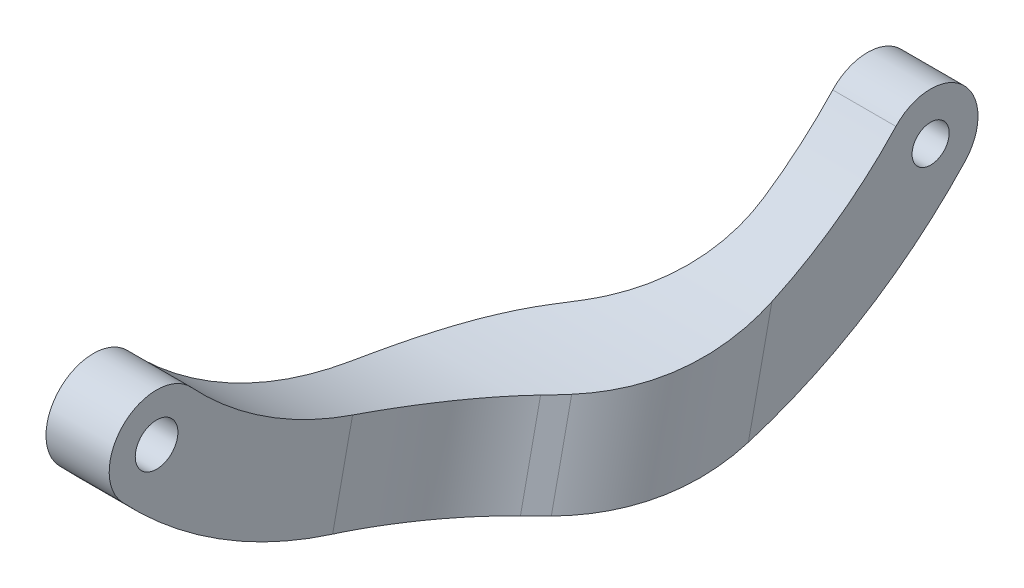
ISO-10303-21;
HEADER;
FILE_DESCRIPTION(('STEP AP214'),'2;1');
FILE_NAME('part.step','',(''),(''),'','','');
FILE_SCHEMA(('AUTOMOTIVE_DESIGN { 1 0 10303 214 1 1 1 1 }'));
ENDSEC;
DATA;
#1=APPLICATION_CONTEXT('core data for automotive mechanical design processes');
#2=APPLICATION_PROTOCOL_DEFINITION('international standard','automotive_design',2000,#1);
#3=PRODUCT_CONTEXT('',#1,'mechanical');
#4=PRODUCT('Part','Part','',(#3));
#5=PRODUCT_RELATED_PRODUCT_CATEGORY('part','',(#4));
#6=PRODUCT_DEFINITION_FORMATION('','',#4);
#7=PRODUCT_DEFINITION_CONTEXT('part definition',#1,'design');
#8=PRODUCT_DEFINITION('design','',#6,#7);
#9=PRODUCT_DEFINITION_SHAPE('','',#8);
#10=(LENGTH_UNIT() NAMED_UNIT(*) SI_UNIT(.MILLI.,.METRE.));
#11=(NAMED_UNIT(*) PLANE_ANGLE_UNIT() SI_UNIT($,.RADIAN.));
#12=(NAMED_UNIT(*) SI_UNIT($,.STERADIAN.) SOLID_ANGLE_UNIT());
#13=UNCERTAINTY_MEASURE_WITH_UNIT(LENGTH_MEASURE(1.E-05),#10,'distance_accuracy_value','');
#14=(GEOMETRIC_REPRESENTATION_CONTEXT(3) GLOBAL_UNCERTAINTY_ASSIGNED_CONTEXT((#13)) GLOBAL_UNIT_ASSIGNED_CONTEXT((#10,
#11,#12)) REPRESENTATION_CONTEXT('',''));
#15=CARTESIAN_POINT('',(0.,0.,0.));
#16=DIRECTION('',(0.,0.,1.));
#17=DIRECTION('',(1.,0.,0.));
#18=AXIS2_PLACEMENT_3D('',#15,#16,#17);
#19=CARTESIAN_POINT('',(4.,0.,20.5));
#20=DIRECTION('',(-1.,0.,0.));
#21=DIRECTION('',(0.,0.,1.));
#22=AXIS2_PLACEMENT_3D('',#19,#20,#21);
#23=CYLINDRICAL_SURFACE('',#22,1.35);
#24=CARTESIAN_POINT('',(4.,0.,20.5));
#25=DIRECTION('',(1.,0.,0.));
#26=DIRECTION('',(0.,0.,-1.));
#27=AXIS2_PLACEMENT_3D('',#24,#25,#26);
#28=CIRCLE('',#27,1.35);
#29=CARTESIAN_POINT('',(4.,0.,19.15));
#30=VERTEX_POINT('',#29);
#31=EDGE_CURVE('E332',#30,#30,#28,.T.);
#32=ORIENTED_EDGE('',*,*,#31,.T.);
#33=EDGE_LOOP('',(#32));
#34=FACE_BOUND('',#33,.T.);
#35=CARTESIAN_POINT('',(1.,0.,20.5));
#36=DIRECTION('',(-1.,0.,0.));
#37=DIRECTION('',(0.,0.,1.));
#38=AXIS2_PLACEMENT_3D('',#35,#36,#37);
#39=CIRCLE('',#38,1.35);
#40=CARTESIAN_POINT('',(1.,0.,21.85));
#41=VERTEX_POINT('',#40);
#42=EDGE_CURVE('E182',#41,#41,#39,.T.);
#43=ORIENTED_EDGE('',*,*,#42,.T.);
#44=EDGE_LOOP('',(#43));
#45=FACE_BOUND('',#44,.T.);
#46=ADVANCED_FACE('F45',(#34,#45),#23,.F.);
#47=CARTESIAN_POINT('',(4.,19.0722311227607,0.));
#48=DIRECTION('',(-1.,0.,0.));
#49=DIRECTION('',(0.,0.,1.));
#50=AXIS2_PLACEMENT_3D('',#47,#48,#49);
#51=CYLINDRICAL_SURFACE('',#50,25.);
#52=CARTESIAN_POINT('',(1.99999999999982,19.0722311227607,0.));
#53=DIRECTION('',(-0.707106781186544,-0.147816494294591,-0.691484116964708));
#54=DIRECTION('',(-0.707106781186551,0.147816494294589,0.691484116964701));
#55=AXIS2_PLACEMENT_3D('',#52,#53,#54);
#56=ELLIPSE('',#55,35.3553390593276,25.);
#57=CARTESIAN_POINT('',(7.51471862576149,-5.92602228819655,-0.29551040855904));
#58=VERTEX_POINT('',#57);
#59=CARTESIAN_POINT('',(8.48528137423854,-5.89421621463096,-1.29480011942044));
#60=VERTEX_POINT('',#59);
#61=EDGE_CURVE('E187',#58,#60,#56,.F.);
#62=ORIENTED_EDGE('',*,*,#61,.T.);
#63=CARTESIAN_POINT('',(8.48528137423853,-5.89421621463096,-1.29480011942042));
#64=CARTESIAN_POINT('',(8.59867285164074,-5.88813550712738,-1.41205145218557));
#65=CARTESIAN_POINT('',(8.70958465029113,-5.88110570858869,-1.53162319514024));
#66=CARTESIAN_POINT('',(8.92629957940963,-5.86496337583373,-1.77517036013413));
#67=CARTESIAN_POINT('',(9.03210280255711,-5.8558508794188,-1.89914570221274));
#68=CARTESIAN_POINT('',(9.34154808412654,-5.82512044837523,-2.27722579073465));
#69=CARTESIAN_POINT('',(9.53731787727653,-5.8001049430657,-2.53757999504009));
#70=CARTESIAN_POINT('',(9.90553356687775,-5.73989390432,-3.07083585190078));
#71=CARTESIAN_POINT('',(10.0781101559172,-5.70475925217093,-3.34365448861928));
#72=CARTESIAN_POINT('',(10.4006110251683,-5.62318193487899,-3.9007432539146));
#73=CARTESIAN_POINT('',(10.5505359838089,-5.57673960851615,-4.18501303919996));
#74=CARTESIAN_POINT('',(10.8274422499721,-5.47171946586164,-4.76241631318454));
#75=CARTESIAN_POINT('',(10.9544181815503,-5.41313881297647,-5.0555518600154));
#76=CARTESIAN_POINT('',(11.185480557955,-5.28330816536979,-5.64797962231596));
#77=CARTESIAN_POINT('',(11.2895652613934,-5.21205720753439,-5.94727230428042));
#78=CARTESIAN_POINT('',(11.4754334349686,-5.05651728357979,-6.5498423253075));
#79=CARTESIAN_POINT('',(11.557185688062,-4.9722103225017,-6.85312462718402));
#80=CARTESIAN_POINT('',(11.6989979415523,-4.79065989901722,-7.46076708218535));
#81=CARTESIAN_POINT('',(11.7590616422833,-4.6934186472376,-7.76512704249201));
#82=CARTESIAN_POINT('',(11.8747990437493,-4.45242830436828,-8.47178858508545));
#83=CARTESIAN_POINT('',(11.9226915947409,-4.30383918757815,-8.87374977045388));
#84=CARTESIAN_POINT('',(11.9696254672786,-4.06518951307501,-9.47131078683301));
#85=CARTESIAN_POINT('',(11.9811206581418,-3.98315430652908,-9.66929163274227));
#86=CARTESIAN_POINT('',(11.9963064961889,-3.8139069769279,-10.063331503492));
#87=CARTESIAN_POINT('',(11.9999972050115,-3.72669489476448,-10.2593905434984));
#88=CARTESIAN_POINT('',(12.,-3.63695797400753,-10.4543163605864));
#89=B_SPLINE_CURVE_WITH_KNOTS('',3,(#63,#64,#65,#66,#67,#68,#69,#70,#71,#72,#73,#74,#75,#76,#77,
#78,#79,#80,#81,#82,#83,#84,#85,#86,#87,#88),.UNSPECIFIED.,.F.,.F.,(4,2,2,2,2,2,2,2,2,2,2,2,4),
(0.,0.489596614265084,0.979184342967121,1.95796306082216,2.93097181208641,3.90395141541273,
4.87715865033372,5.85043989376419,6.82507474032123,7.79954322351979,9.09094210412101,
9.73460562922835,10.3782640707513),.UNSPECIFIED.);
#90=CARTESIAN_POINT('',(12.,-3.63695797400752,-10.4543163605864));
#91=VERTEX_POINT('',#90);
#92=EDGE_CURVE('E269',#60,#91,#89,.T.);
#93=ORIENTED_EDGE('',*,*,#92,.T.);
#94=CARTESIAN_POINT('',(12.,19.0722311227607,0.));
#95=DIRECTION('',(1.,0.,0.));
#96=DIRECTION('',(0.,0.,-1.));
#97=AXIS2_PLACEMENT_3D('',#94,#95,#96);
#98=CIRCLE('',#97,25.);
#99=CARTESIAN_POINT('',(12.,2.04345333458149,-18.3035714285714));
#100=VERTEX_POINT('',#99);
#101=EDGE_CURVE('E342',#91,#100,#98,.T.);
#102=ORIENTED_EDGE('',*,*,#101,.T.);
#103=DIRECTION('',(-1.,0.,0.));
#104=VECTOR('',#103,1.);
#105=CARTESIAN_POINT('',(4.,2.04345333458149,-18.3035714285714));
#106=LINE('',#105,#104);
#107=CARTESIAN_POINT('',(8.,2.04345333458149,-18.3035714285714));
#108=VERTEX_POINT('',#107);
#109=EDGE_CURVE('E171',#100,#108,#106,.T.);
#110=ORIENTED_EDGE('',*,*,#109,.T.);
#111=CARTESIAN_POINT('',(8.,19.0722311227607,0.));
#112=DIRECTION('',(1.,0.,0.));
#113=DIRECTION('',(0.,0.,-1.));
#114=AXIS2_PLACEMENT_3D('',#111,#112,#113);
#115=CIRCLE('',#114,25.);
#116=CARTESIAN_POINT('',(8.,-1.68038995029258,-13.940183592703));
#117=VERTEX_POINT('',#116);
#118=EDGE_CURVE('E162',#117,#108,#115,.T.);
#119=ORIENTED_EDGE('',*,*,#118,.F.);
#120=CARTESIAN_POINT('',(8.,-1.68038995029259,-13.940183592703));
#121=CARTESIAN_POINT('',(8.0000006447647,-1.76731669645823,-13.810779522855));
#122=CARTESIAN_POINT('',(7.99700455162078,-1.85301952102906,-13.6805757927997));
#123=CARTESIAN_POINT('',(7.9849935332434,-2.02185269140391,-13.4187882534438));
#124=CARTESIAN_POINT('',(7.97597869262896,-2.10498307335733,-13.2872044635714));
#125=CARTESIAN_POINT('',(7.93987660512794,-2.35027301366119,-12.8908020485648));
#126=CARTESIAN_POINT('',(7.90373182824183,-2.50839447835756,-12.6242383759934));
#127=CARTESIAN_POINT('',(7.80754571796463,-2.8123447489946,-12.0896496542054));
#128=CARTESIAN_POINT('',(7.74758217109181,-2.95821171496135,-11.8216321357815));
#129=CARTESIAN_POINT('',(7.60413670663273,-3.23762089578244,-11.2854717949295));
#130=CARTESIAN_POINT('',(7.52065548062648,-3.37116347290451,-11.0173289764175));
#131=CARTESIAN_POINT('',(7.33079172614606,-3.62559502450517,-10.483140549654));
#132=CARTESIAN_POINT('',(7.22440722973564,-3.74648291031706,-10.2170951236561));
#133=CARTESIAN_POINT('',(6.98956380624268,-3.9755482891721,-9.68930533106975));
#134=CARTESIAN_POINT('',(6.86110372936444,-4.08372511967182,-9.42756118928998));
#135=CARTESIAN_POINT('',(6.58307713178323,-4.28757862991995,-8.91047343522586));
#136=CARTESIAN_POINT('',(6.43350861078629,-4.38325412335073,-8.65513043223459));
#137=CARTESIAN_POINT('',(6.11439925625423,-4.56250250664319,-8.15294162398527));
#138=CARTESIAN_POINT('',(5.94486388526901,-4.64607869276094,-7.90609351845555));
#139=CARTESIAN_POINT('',(5.57311159144304,-4.80777163206693,-7.40406698794985));
#140=CARTESIAN_POINT('',(5.36938299699754,-4.88497145962042,-7.14971235281972));
#141=CARTESIAN_POINT('',(4.94198196575353,-5.02688136041803,-6.65574242050241));
#142=CARTESIAN_POINT('',(4.71835815156656,-5.09162072330045,-6.41609348299118));
#143=CARTESIAN_POINT('',(4.48528137423853,-5.1507111807628,-6.1845829414904));
#144=B_SPLINE_CURVE_WITH_KNOTS('',3,(#120,#121,#122,#123,#124,#125,#126,#127,#128,#129,#130,
#131,#132,#133,#134,#135,#136,#137,#138,#139,#140,#141,#142,#143),.UNSPECIFIED.,.F.,.F.,(4,2,2,
2,2,2,2,2,2,2,2,4),(0.,0.467596240150389,0.935185906390633,1.87002670498385,2.80183930735431,
3.73362451094543,4.66548980904839,5.59740365761386,6.52940587625938,7.46115370656914,
8.4646982641753,9.46585427697592),.UNSPECIFIED.);
#145=CARTESIAN_POINT('',(4.48528137423852,-5.1507111807628,-6.18458294149039));
#146=VERTEX_POINT('',#145);
#147=EDGE_CURVE('E239',#117,#146,#144,.T.);
#148=ORIENTED_EDGE('',*,*,#147,.T.);
#149=CARTESIAN_POINT('',(10.0000000000002,19.0722311227607,0.));
#150=DIRECTION('',(0.707106781186544,-0.321749028247022,0.629664643141174));
#151=DIRECTION('',(-0.707106781186551,-0.321749028247019,0.629664643141168));
#152=AXIS2_PLACEMENT_3D('',#149,#150,#151);
#153=ELLIPSE('',#152,35.3553390593276,25.);
#154=CARTESIAN_POINT('',(3.51471862576147,-5.37862408161887,-5.21111118423573));
#155=VERTEX_POINT('',#154);
#156=EDGE_CURVE('E181',#146,#155,#153,.F.);
#157=ORIENTED_EDGE('',*,*,#156,.T.);
#158=CARTESIAN_POINT('',(3.51471862576147,-5.37862408161887,-5.21111118423573));
#159=CARTESIAN_POINT('',(3.40132714835927,-5.40309744718233,-5.09628129084143));
#160=CARTESIAN_POINT('',(3.29041534970887,-5.42725462755297,-4.97896441048207));
#161=CARTESIAN_POINT('',(3.07370042059037,-5.47469697612954,-4.73953797074562));
#162=CARTESIAN_POINT('',(2.96789719744289,-5.49798216015344,-4.61742849838826));
#163=CARTESIAN_POINT('',(2.65845191587346,-5.56615317063897,-4.244277555661));
#164=CARTESIAN_POINT('',(2.46268212272347,-5.60937467454959,-3.98632021654247));
#165=CARTESIAN_POINT('',(2.09446643312225,-5.68923204886544,-3.45565084882803));
#166=CARTESIAN_POINT('',(1.92188984408278,-5.72590523999864,-3.18303476460943));
#167=CARTESIAN_POINT('',(1.59938897483173,-5.79129278465805,-2.62381457531166));
#168=CARTESIAN_POINT('',(1.4494640161911,-5.82000737657028,-2.33721088950931));
#169=CARTESIAN_POINT('',(1.17255775002795,-5.86800867251149,-1.75230094194538));
#170=CARTESIAN_POINT('',(1.04558181844973,-5.8872931692852,-1.45399195801685));
#171=CARTESIAN_POINT('',(0.81451944204503,-5.91521798144893,-0.848148037961502));
#172=CARTESIAN_POINT('',(0.710434738606563,-5.9238574872801,-0.540612401963109));
#173=CARTESIAN_POINT('',(0.524566565031372,-5.92957405516294,0.0816822380877375));
#174=CARTESIAN_POINT('',(0.442814311938032,-5.92663501988984,0.396450693288391));
#175=CARTESIAN_POINT('',(0.301002058447687,-5.90854021703966,1.03037694096808));
#176=CARTESIAN_POINT('',(0.240938357716654,-5.89338653485906,1.34953397504678));
#177=CARTESIAN_POINT('',(0.125200956250701,-5.84350520446004,2.09448949990342));
#178=CARTESIAN_POINT('',(0.0773084052590687,-5.8040143492123,2.5212118833368));
#179=CARTESIAN_POINT('',(0.0303745327213871,-5.72815663682397,3.16017858270988));
#180=CARTESIAN_POINT('',(0.0188793418581842,-5.70015792564313,3.3726456687072));
#181=CARTESIAN_POINT('',(0.00369350381111975,-5.63866258203065,3.79706338868547));
#182=CARTESIAN_POINT('',(2.79498853896766E-06,-5.60516599302273,4.00901402673206));
#183=CARTESIAN_POINT('',(0.,-5.56893729753649,4.22052353180866));
#184=B_SPLINE_CURVE_WITH_KNOTS('',3,(#158,#159,#160,#161,#162,#163,#164,#165,#166,#167,#168,
#169,#170,#171,#172,#173,#174,#175,#176,#177,#178,#179,#180,#181,#182,#183),.UNSPECIFIED.,.F.,
.F.,(4,2,2,2,2,2,2,2,2,2,2,2,4),(0.,0.489596614265083,0.979184342967119,1.95796306082215,
2.93097181208641,3.90395141541273,4.87715865033372,5.85043989376419,6.82507474032123,
7.79954322351979,9.09094210412101,9.73460562922835,10.3782640707513),.UNSPECIFIED.);
#185=CARTESIAN_POINT('',(0.,-5.5689372975365,4.22052353180866));
#186=VERTEX_POINT('',#185);
#187=EDGE_CURVE('E67',#155,#186,#184,.T.);
#188=ORIENTED_EDGE('',*,*,#187,.T.);
#189=CARTESIAN_POINT('',(0.,19.0722311227607,0.));
#190=DIRECTION('',(1.,0.,0.));
#191=DIRECTION('',(0.,0.,-1.));
#192=AXIS2_PLACEMENT_3D('',#189,#190,#191);
#193=CIRCLE('',#192,25.);
#194=CARTESIAN_POINT('',(0.,2.0434533345815,18.3035714285714));
#195=VERTEX_POINT('',#194);
#196=EDGE_CURVE('E325',#195,#186,#193,.T.);
#197=ORIENTED_EDGE('',*,*,#196,.F.);
#198=DIRECTION('',(-1.,0.,0.));
#199=VECTOR('',#198,1.);
#200=CARTESIAN_POINT('',(4.,2.0434533345815,18.3035714285714));
#201=LINE('',#200,#199);
#202=CARTESIAN_POINT('',(4.,2.0434533345815,18.3035714285714));
#203=VERTEX_POINT('',#202);
#204=EDGE_CURVE('E174',#203,#195,#201,.T.);
#205=ORIENTED_EDGE('',*,*,#204,.F.);
#206=CARTESIAN_POINT('',(4.,19.0722311227607,0.));
#207=DIRECTION('',(1.,0.,0.));
#208=DIRECTION('',(0.,0.,-1.));
#209=AXIS2_PLACEMENT_3D('',#206,#207,#208);
#210=CIRCLE('',#209,25.);
#211=CARTESIAN_POINT('',(4.,-4.58124654090946,8.09400978590088));
#212=VERTEX_POINT('',#211);
#213=EDGE_CURVE('E321',#203,#212,#210,.T.);
#214=ORIENTED_EDGE('',*,*,#213,.T.);
#215=CARTESIAN_POINT('',(4.,-4.58124654090946,8.09400978590088));
#216=CARTESIAN_POINT('',(3.99999935523531,-4.63171909223569,7.94651675537132));
#217=CARTESIAN_POINT('',(4.00299544837922,-4.68080245879287,7.79856808661368));
#218=CARTESIAN_POINT('',(4.0150064667566,-4.77612717743636,7.50200350141109));
#219=CARTESIAN_POINT('',(4.02402130737104,-4.8223685694687,7.35338759437618));
#220=CARTESIAN_POINT('',(4.06012339487206,-4.95670396320877,6.90700655599529));
#221=CARTESIAN_POINT('',(4.09626817175817,-5.04044581445568,6.60860097380513));
#222=CARTESIAN_POINT('',(4.19245428203537,-5.19567748827582,6.01355980218232));
#223=CARTESIAN_POINT('',(4.25241782890819,-5.26720611971631,5.71692161039528));
#224=CARTESIAN_POINT('',(4.39586329336727,-5.39832615613252,5.12671407276136));
#225=CARTESIAN_POINT('',(4.47934451937352,-5.45791791204554,4.8331446369354));
#226=CARTESIAN_POINT('',(4.66920827385394,-5.56542178023968,4.2513065081906));
#227=CARTESIAN_POINT('',(4.77559277026436,-5.61333288812019,3.96303827308284));
#228=CARTESIAN_POINT('',(5.01043619375732,-5.6979910033329,3.39394599895063));
#229=CARTESIAN_POINT('',(5.13889627063556,-5.73473742888206,3.11312234855353));
#230=CARTESIAN_POINT('',(5.41692286821677,-5.79781264046933,2.56089276158197));
#231=CARTESIAN_POINT('',(5.56649138921372,-5.82414043830926,2.28948772058103));
#232=CARTESIAN_POINT('',(5.88560074374577,-5.86730505323975,1.75801768561976));
#233=CARTESIAN_POINT('',(6.05513611473099,-5.88414445891506,1.49794961663376));
#234=CARTESIAN_POINT('',(6.42688840855696,-5.91039381767768,0.971180013185019));
#235=CARTESIAN_POINT('',(6.63061700300246,-5.91913130111489,0.705511516427016));
#236=CARTESIAN_POINT('',(7.05801803424647,-5.92835691310969,0.191644216376436));
#237=CARTESIAN_POINT('',(7.28164184843344,-5.92886462652882,-0.0565946616901713));
#238=CARTESIAN_POINT('',(7.51471862576147,-5.92602228819655,-0.295510408559021));
#239=B_SPLINE_CURVE_WITH_KNOTS('',3,(#215,#216,#217,#218,#219,#220,#221,#222,#223,#224,#225,
#226,#227,#228,#229,#230,#231,#232,#233,#234,#235,#236,#237,#238),.UNSPECIFIED.,.F.,.F.,(4,2,2,
2,2,2,2,2,2,2,2,4),(0.,0.46759624015039,0.935185906390632,1.87002670498385,2.80183930735431,
3.73362451094543,4.66548980904839,5.59740365761386,6.52940587625939,7.46115370656915,
8.4646982641753,9.46585427697592),.UNSPECIFIED.);
#240=EDGE_CURVE('E60',#212,#58,#239,.T.);
#241=ORIENTED_EDGE('',*,*,#240,.T.);
#242=EDGE_LOOP('',(#62,#93,#102,#110,#119,#148,#157,#188,#197,#205,#214,#241));
#243=FACE_BOUND('',#242,.T.);
#244=ADVANCED_FACE('F279',(#243),#51,.F.);
#245=CARTESIAN_POINT('',(4.,0.,20.5));
#246=DIRECTION('',(-1.,0.,0.));
#247=DIRECTION('',(0.,0.,1.));
#248=AXIS2_PLACEMENT_3D('',#245,#246,#247);
#249=CYLINDRICAL_SURFACE('',#248,3.);
#250=CARTESIAN_POINT('',(0.,0.,20.5));
#251=DIRECTION('',(1.,0.,0.));
#252=DIRECTION('',(0.,0.,-1.));
#253=AXIS2_PLACEMENT_3D('',#250,#251,#252);
#254=CIRCLE('',#253,3.);
#255=CARTESIAN_POINT('',(0.,-2.04345333458148,22.6964285714286));
#256=VERTEX_POINT('',#255);
#257=EDGE_CURVE('E327',#195,#256,#254,.T.);
#258=ORIENTED_EDGE('',*,*,#257,.T.);
#259=DIRECTION('',(-1.,0.,0.));
#260=VECTOR('',#259,1.);
#261=CARTESIAN_POINT('',(4.,-2.04345333458148,22.6964285714286));
#262=LINE('',#261,#260);
#263=CARTESIAN_POINT('',(4.,-2.04345333458148,22.6964285714286));
#264=VERTEX_POINT('',#263);
#265=EDGE_CURVE('E170',#264,#256,#262,.T.);
#266=ORIENTED_EDGE('',*,*,#265,.F.);
#267=CARTESIAN_POINT('',(4.,0.,20.5));
#268=DIRECTION('',(1.,0.,0.));
#269=DIRECTION('',(0.,0.,-1.));
#270=AXIS2_PLACEMENT_3D('',#267,#268,#269);
#271=CIRCLE('',#270,3.);
#272=EDGE_CURVE('E318',#203,#264,#271,.T.);
#273=ORIENTED_EDGE('',*,*,#272,.F.);
#274=ORIENTED_EDGE('',*,*,#204,.T.);
#275=EDGE_LOOP('',(#258,#266,#273,#274));
#276=FACE_BOUND('',#275,.T.);
#277=ADVANCED_FACE('F226',(#276),#249,.T.);
#278=CARTESIAN_POINT('',(4.,19.0722311227607,0.));
#279=DIRECTION('',(-1.,0.,0.));
#280=DIRECTION('',(0.,0.,1.));
#281=AXIS2_PLACEMENT_3D('',#278,#279,#280);
#282=CYLINDRICAL_SURFACE('',#281,31.);
#283=CARTESIAN_POINT('',(12.,19.0722311227607,0.));
#284=DIRECTION('',(1.,0.,0.));
#285=DIRECTION('',(0.,0.,-1.));
#286=AXIS2_PLACEMENT_3D('',#283,#284,#285);
#287=CIRCLE('',#286,31.);
#288=CARTESIAN_POINT('',(12.,-10.6031032585401,-8.96518429024137));
#289=VERTEX_POINT('',#288);
#290=CARTESIAN_POINT('',(12.,-2.0434533345815,-22.6964285714286));
#291=VERTEX_POINT('',#290);
#292=EDGE_CURVE('E340',#289,#291,#287,.T.);
#293=ORIENTED_EDGE('',*,*,#292,.F.);
#294=CARTESIAN_POINT('',(12.,-10.6031032585401,-8.96518429024136));
#295=CARTESIAN_POINT('',(11.999999844027,-10.6540662239047,-8.79649877632725));
#296=CARTESIAN_POINT('',(11.9970233240064,-10.703584108635,-8.62738948027358));
#297=CARTESIAN_POINT('',(11.9849541563195,-10.7996789263097,-8.28854587266914));
#298=CARTESIAN_POINT('',(11.9758611810753,-10.8462557015914,-8.11881152812701));
#299=CARTESIAN_POINT('',(11.9391523615506,-10.9815290872347,-7.60888541447888));
#300=CARTESIAN_POINT('',(11.9021063396546,-11.0657247068599,-7.26811646153368));
#301=CARTESIAN_POINT('',(11.8015870309671,-11.2220096148917,-6.58647191758017));
#302=CARTESIAN_POINT('',(11.7380283761501,-11.2940587308761,-6.24559956896927));
#303=CARTESIAN_POINT('',(11.6222796760634,-11.3927282990199,-5.73725492007071));
#304=CARTESIAN_POINT('',(11.580299252889,-11.424048629329,-5.56831436372982));
#305=CARTESIAN_POINT('',(11.4894497116109,-11.4835970560486,-5.23169106212182));
#306=CARTESIAN_POINT('',(11.4405785196324,-11.5118242169638,-5.06400871159028));
#307=CARTESIAN_POINT('',(11.2831048192614,-11.5921255986205,-4.56204490828782));
#308=CARTESIAN_POINT('',(11.1639578036145,-11.6395498951432,-4.23024468632598));
#309=CARTESIAN_POINT('',(10.8976202757445,-11.7225148426613,-3.5766201423528));
#310=CARTESIAN_POINT('',(10.7504315810433,-11.7580562634344,-3.25479517536609));
#311=CARTESIAN_POINT('',(10.4288962115099,-11.8180295658365,-2.62516624232572));
#312=CARTESIAN_POINT('',(10.2546341239244,-11.8424951508552,-2.3173223400941));
#313=CARTESIAN_POINT('',(9.87957617131439,-11.8815960594445,-1.71778525668446));
#314=CARTESIAN_POINT('',(9.67879511701478,-11.8962368425715,-1.42608318846158));
#315=CARTESIAN_POINT('',(9.31427779915106,-11.91404068315,-0.94393373398131));
#316=CARTESIAN_POINT('',(9.156825776669,-11.9193062439275,-0.748776100057299));
#317=CARTESIAN_POINT('',(8.82992367421313,-11.9261565800748,-0.368895509697338));
#318=CARTESIAN_POINT('',(8.66048003170928,-11.9277433151351,-0.184167048890824));
#319=CARTESIAN_POINT('',(8.48528137423853,-11.9277684698617,-0.00502567539374697));
#320=B_SPLINE_CURVE_WITH_KNOTS('',3,(#294,#295,#296,#297,#298,#299,#300,#301,#302,#303,#304,
#305,#306,#307,#308,#309,#310,#311,#312,#313,#314,#315,#316,#317,#318,#319),.UNSPECIFIED.,.F.,
.F.,(4,2,2,2,2,2,2,2,2,2,2,2,4),(0.,0.528588263307907,1.05720483836752,2.11489391310289,
3.17601525538171,3.70648925701815,4.23712325448235,5.30275120239005,6.36831010508454,
7.43060438692015,8.49230787121587,9.24423333087792,9.99575815179277),.UNSPECIFIED.);
#321=CARTESIAN_POINT('',(8.48528137423855,-11.9277684698617,-0.00502567539377181));
#322=VERTEX_POINT('',#321);
#323=EDGE_CURVE('E216',#289,#322,#320,.T.);
#324=ORIENTED_EDGE('',*,*,#323,.T.);
#325=CARTESIAN_POINT('',(1.99999999999982,19.0722311227607,0.));
#326=DIRECTION('',(-0.707106781186544,-0.147816494294591,-0.691484116964708));
#327=DIRECTION('',(-0.707106781186551,0.147816494294589,0.691484116964701));
#328=AXIS2_PLACEMENT_3D('',#325,#326,#327);
#329=ELLIPSE('',#328,43.8406204335662,31.);
#330=CARTESIAN_POINT('',(7.51471862576147,-11.9121439412577,0.984124937311979));
#331=VERTEX_POINT('',#330);
#332=EDGE_CURVE('E192',#322,#331,#329,.T.);
#333=ORIENTED_EDGE('',*,*,#332,.T.);
#334=CARTESIAN_POINT('',(7.51471862576147,-11.9121439412577,0.984124937311976));
#335=CARTESIAN_POINT('',(7.28325248387528,-11.9046913313905,1.21919149463711));
#336=CARTESIAN_POINT('',(7.06118630516061,-11.8942431904213,1.46344346435228));
#337=CARTESIAN_POINT('',(6.63719708889755,-11.8662327174943,1.96855772814631));
#338=CARTESIAN_POINT('',(6.4352787677703,-11.8486687246301,2.22942388814398));
#339=CARTESIAN_POINT('',(6.0526181200821,-11.8052582321151,2.76648369098321));
#340=CARTESIAN_POINT('',(5.87192327878564,-11.7793936254159,3.04270974078674));
#341=CARTESIAN_POINT('',(5.53356078616136,-11.7184118892437,3.60791619946372));
#342=CARTESIAN_POINT('',(5.37589050907722,-11.6832958161047,3.89689514907478));
#343=CARTESIAN_POINT('',(5.08443547947474,-11.6028906462525,4.48614724278485));
#344=CARTESIAN_POINT('',(4.95070645401737,-11.5575783551348,4.78644481712871));
#345=CARTESIAN_POINT('',(4.70866481482967,-11.4562052388317,5.39535098929606));
#346=CARTESIAN_POINT('',(4.6003510995931,-11.4001448796617,5.70395922628674));
#347=CARTESIAN_POINT('',(4.41024564315482,-11.2770485096952,6.32626132187458));
#348=CARTESIAN_POINT('',(4.32839085381433,-11.2100391717115,6.63994119252494));
#349=CARTESIAN_POINT('',(4.19151357489834,-11.06488156872,7.2704204002199));
#350=CARTESIAN_POINT('',(4.13647800540797,-10.9867387576634,7.58721813959219));
#351=CARTESIAN_POINT('',(4.06331828568653,-10.8392185917292,8.14665469098803));
#352=CARTESIAN_POINT('',(4.0395516351711,-10.7721162793819,8.38917355600015));
#353=CARTESIAN_POINT('',(4.00789164086642,-10.6317915433787,8.87326027734233));
#354=CARTESIAN_POINT('',(3.99998534597654,-10.558574164043,9.11482874871432));
#355=CARTESIAN_POINT('',(4.,-10.4823800457795,9.35547746918356));
#356=B_SPLINE_CURVE_WITH_KNOTS('',3,(#334,#335,#336,#337,#338,#339,#340,#341,#342,#343,#344,
#345,#346,#347,#348,#349,#350,#351,#352,#353,#354,#355),.UNSPECIFIED.,.F.,.F.,(4,2,2,2,2,2,2,2,
2,2,4),(0.,0.989701900786847,1.9796349404786,2.97174227901973,3.96373638762533,4.95801032037492,
5.95224115306799,6.94408509424891,7.93544482109814,8.69314542063249,9.45022705184502),.UNSPECIFIED.);
#357=CARTESIAN_POINT('',(4.,-10.4823800457795,9.35547746918357));
#358=VERTEX_POINT('',#357);
#359=EDGE_CURVE('E11',#331,#358,#356,.T.);
#360=ORIENTED_EDGE('',*,*,#359,.T.);
#361=CARTESIAN_POINT('',(4.,19.0722311227607,0.));
#362=DIRECTION('',(1.,0.,0.));
#363=DIRECTION('',(0.,0.,-1.));
#364=AXIS2_PLACEMENT_3D('',#361,#362,#363);
#365=CIRCLE('',#364,31.);
#366=EDGE_CURVE('E176',#264,#358,#365,.T.);
#367=ORIENTED_EDGE('',*,*,#366,.F.);
#368=ORIENTED_EDGE('',*,*,#265,.T.);
#369=CARTESIAN_POINT('',(0.,19.0722311227607,0.));
#370=DIRECTION('',(1.,0.,0.));
#371=DIRECTION('',(0.,0.,-1.));
#372=AXIS2_PLACEMENT_3D('',#369,#370,#371);
#373=CIRCLE('',#372,31.);
#374=CARTESIAN_POINT('',(0.,-11.91230119707,0.979161335718888));
#375=VERTEX_POINT('',#374);
#376=EDGE_CURVE('E330',#256,#375,#373,.T.);
#377=ORIENTED_EDGE('',*,*,#376,.T.);
#378=CARTESIAN_POINT('',(0.,-11.91230119707,0.979161335718888));
#379=CARTESIAN_POINT('',(1.55973032108938E-07,-11.9178686178661,0.803033455277141));
#380=CARTESIAN_POINT('',(0.00297667599355301,-11.9219305150678,0.626870247111941));
#381=CARTESIAN_POINT('',(0.0150458436804961,-11.927051802273,0.274701286503998));
#382=CARTESIAN_POINT('',(0.0241388189247055,-11.9281110314474,0.0986955430001251));
#383=CARTESIAN_POINT('',(0.0608476384493599,-11.9267964984425,-0.428866588171787));
#384=CARTESIAN_POINT('',(0.0978936603453943,-11.9199257268971,-0.779815550492262));
#385=CARTESIAN_POINT('',(0.198412969032949,-11.8944627658589,-1.47868313050673));
#386=CARTESIAN_POINT('',(0.261971623849861,-11.8758326119801,-1.82658821889735));
#387=CARTESIAN_POINT('',(0.377720323936645,-11.8395708195081,-2.34314900733199));
#388=CARTESIAN_POINT('',(0.419700747110956,-11.8260989019704,-2.5144393517922));
#389=CARTESIAN_POINT('',(0.510550288389076,-11.7964937437722,-2.85500475948697));
#390=CARTESIAN_POINT('',(0.559421480367623,-11.7803597016579,-3.02427919931226));
#391=CARTESIAN_POINT('',(0.716895180738651,-11.72800708784,-3.52992252770519));
#392=CARTESIAN_POINT('',(0.836042196385478,-11.687939224032,-3.86269124240726));
#393=CARTESIAN_POINT('',(1.10237972425549,-11.5989067291897,-4.51551697862098));
#394=CARTESIAN_POINT('',(1.24956841895669,-11.5499426747718,-4.83557482236415));
#395=CARTESIAN_POINT('',(1.57110378849012,-11.4449124772314,-5.45927190262602));
#396=CARTESIAN_POINT('',(1.74536587607563,-11.38886855284,-5.76295843760956));
#397=CARTESIAN_POINT('',(2.12042382868561,-11.2714655148461,-6.35218685011669));
#398=CARTESIAN_POINT('',(2.32120488298521,-11.2101093746337,-6.63773872490359));
#399=CARTESIAN_POINT('',(2.68572220084894,-11.1025171026503,-7.10806730813494));
#400=CARTESIAN_POINT('',(2.843174223331,-11.0570927313386,-7.29793793435199));
#401=CARTESIAN_POINT('',(3.17007632578687,-10.965389316292,-7.66664740494688));
#402=CARTESIAN_POINT('',(3.33951996829071,-10.919110740837,-7.84549207334365));
#403=CARTESIAN_POINT('',(3.51471862576147,-10.8727698392103,-8.0185358630837));
#404=B_SPLINE_CURVE_WITH_KNOTS('',3,(#378,#379,#380,#381,#382,#383,#384,#385,#386,#387,#388,
#389,#390,#391,#392,#393,#394,#395,#396,#397,#398,#399,#400,#401,#402,#403),.UNSPECIFIED.,.F.,
.F.,(4,2,2,2,2,2,2,2,2,2,2,2,4),(0.,0.528588263307906,1.05720483836751,2.11489391310289,
3.17601525538171,3.70648925701815,4.23712325448234,5.30275120239005,6.36831010508453,
7.43060438692015,8.49230787121586,9.24423333087792,9.99575815179277),.UNSPECIFIED.);
#405=CARTESIAN_POINT('',(3.51471862576147,-10.8727698392103,-8.0185358630837));
#406=VERTEX_POINT('',#405);
#407=EDGE_CURVE('E75',#375,#406,#404,.T.);
#408=ORIENTED_EDGE('',*,*,#407,.T.);
#409=CARTESIAN_POINT('',(10.0000000000002,19.0722311227607,0.));
#410=DIRECTION('',(0.707106781186544,-0.321749028247022,0.629664643141174));
#411=DIRECTION('',(-0.707106781186551,-0.321749028247019,0.629664643141168));
#412=AXIS2_PLACEMENT_3D('',#409,#410,#411);
#413=ELLIPSE('',#412,43.8406204335662,31.);
#414=CARTESIAN_POINT('',(4.48528137423853,-10.601666686465,-8.96993806041235));
#415=VERTEX_POINT('',#414);
#416=EDGE_CURVE('E190',#406,#415,#413,.T.);
#417=ORIENTED_EDGE('',*,*,#416,.T.);
#418=CARTESIAN_POINT('',(4.48528137423853,-10.601666686465,-8.96993806041235));
#419=CARTESIAN_POINT('',(4.71674751612472,-10.5336283162186,-9.19506604166022));
#420=CARTESIAN_POINT('',(4.93881369483939,-10.4603191254536,-9.42829114946132));
#421=CARTESIAN_POINT('',(5.36280291110245,-10.302529894824,-9.90894441823114));
#422=CARTESIAN_POINT('',(5.5647212322297,-10.2180472500736,-10.1563758835164));
#423=CARTESIAN_POINT('',(5.9473818799179,-10.0371146288877,-10.6639003551204));
#424=CARTESIAN_POINT('',(6.12807672121436,-9.94063877484752,-10.9240199777116));
#425=CARTESIAN_POINT('',(6.46643921383864,-9.73544874502625,-11.4541842586083));
#426=CARTESIAN_POINT('',(6.62410949092278,-9.62673596727039,-11.7242277807739));
#427=CARTESIAN_POINT('',(6.91556452052526,-9.39656087292425,-12.2725912070009));
#428=CARTESIAN_POINT('',(7.04929354598262,-9.2750698292471,-12.5509287057132));
#429=CARTESIAN_POINT('',(7.29133518517033,-9.01955440408112,-13.1128496100358));
#430=CARTESIAN_POINT('',(7.39964890040691,-8.88553056611911,-13.3964327877221));
#431=CARTESIAN_POINT('',(7.58975435684518,-8.60556496910068,-13.9656707686739));
#432=CARTESIAN_POINT('',(7.67160914618567,-8.45965259435011,-14.2513189640522));
#433=CARTESIAN_POINT('',(7.80848642510166,-8.15626109024575,-14.8227455615074));
#434=CARTESIAN_POINT('',(7.86352199459203,-7.99878764251239,-15.1085238319378));
#435=CARTESIAN_POINT('',(7.93668171431347,-7.71150127031032,-15.6107170166207));
#436=CARTESIAN_POINT('',(7.9604483648289,-7.58391691274861,-15.8276048952923));
#437=CARTESIAN_POINT('',(7.99210835913358,-7.32308276321133,-16.2588780474237));
#438=CARTESIAN_POINT('',(8.00001465402346,-7.18983768449039,-16.4732652205345));
#439=CARTESIAN_POINT('',(8.,-7.05395534581137,-16.6859935457678));
#440=B_SPLINE_CURVE_WITH_KNOTS('',3,(#418,#419,#420,#421,#422,#423,#424,#425,#426,#427,#428,
#429,#430,#431,#432,#433,#434,#435,#436,#437,#438,#439),.UNSPECIFIED.,.F.,.F.,(4,2,2,2,2,2,2,2,
2,2,4),(0.,0.989701900786847,1.9796349404786,2.97174227901973,3.96373638762533,4.95801032037492,
5.95224115306799,6.94408509424892,7.93544482109814,8.69314542063249,9.45022705184502),.UNSPECIFIED.);
#441=CARTESIAN_POINT('',(8.,-7.05395534581137,-16.6859935457678));
#442=VERTEX_POINT('',#441);
#443=EDGE_CURVE('E152',#415,#442,#440,.T.);
#444=ORIENTED_EDGE('',*,*,#443,.T.);
#445=CARTESIAN_POINT('',(8.,19.0722311227607,0.));
#446=DIRECTION('',(1.,0.,0.));
#447=DIRECTION('',(0.,0.,-1.));
#448=AXIS2_PLACEMENT_3D('',#445,#446,#447);
#449=CIRCLE('',#448,31.);
#450=CARTESIAN_POINT('',(8.,-2.0434533345815,-22.6964285714286));
#451=VERTEX_POINT('',#450);
#452=EDGE_CURVE('E143',#442,#451,#449,.T.);
#453=ORIENTED_EDGE('',*,*,#452,.T.);
#454=DIRECTION('',(-1.,0.,0.));
#455=VECTOR('',#454,1.);
#456=CARTESIAN_POINT('',(4.,-2.0434533345815,-22.6964285714286));
#457=LINE('',#456,#455);
#458=EDGE_CURVE('E148',#291,#451,#457,.T.);
#459=ORIENTED_EDGE('',*,*,#458,.F.);
#460=EDGE_LOOP('',(#293,#324,#333,#360,#367,#368,#377,#408,#417,#444,#453,#459));
#461=FACE_BOUND('',#460,.T.);
#462=ADVANCED_FACE('F146',(#461),#282,.T.);
#463=CARTESIAN_POINT('',(4.,0.,-20.5));
#464=DIRECTION('',(-1.,0.,0.));
#465=DIRECTION('',(0.,0.,1.));
#466=AXIS2_PLACEMENT_3D('',#463,#464,#465);
#467=CYLINDRICAL_SURFACE('',#466,3.);
#468=ORIENTED_EDGE('',*,*,#458,.T.);
#469=CARTESIAN_POINT('',(8.,0.,-20.5));
#470=DIRECTION('',(1.,0.,0.));
#471=DIRECTION('',(0.,0.,-1.));
#472=AXIS2_PLACEMENT_3D('',#469,#470,#471);
#473=CIRCLE('',#472,3.);
#474=EDGE_CURVE('E156',#451,#108,#473,.T.);
#475=ORIENTED_EDGE('',*,*,#474,.T.);
#476=ORIENTED_EDGE('',*,*,#109,.F.);
#477=CARTESIAN_POINT('',(12.,0.,-20.5));
#478=DIRECTION('',(1.,0.,0.));
#479=DIRECTION('',(0.,0.,-1.));
#480=AXIS2_PLACEMENT_3D('',#477,#478,#479);
#481=CIRCLE('',#480,3.);
#482=EDGE_CURVE('E169',#291,#100,#481,.T.);
#483=ORIENTED_EDGE('',*,*,#482,.F.);
#484=EDGE_LOOP('',(#468,#475,#476,#483));
#485=FACE_BOUND('',#484,.T.);
#486=ADVANCED_FACE('F167',(#485),#467,.T.);
#487=CARTESIAN_POINT('',(4.,0.,-20.5));
#488=DIRECTION('',(-1.,0.,0.));
#489=DIRECTION('',(0.,0.,1.));
#490=AXIS2_PLACEMENT_3D('',#487,#488,#489);
#491=CYLINDRICAL_SURFACE('',#490,1.175);
#492=CARTESIAN_POINT('',(8.,0.,-20.5));
#493=DIRECTION('',(1.,0.,0.));
#494=DIRECTION('',(0.,0.,-1.));
#495=AXIS2_PLACEMENT_3D('',#492,#493,#494);
#496=CIRCLE('',#495,1.175);
#497=CARTESIAN_POINT('',(8.,0.,-21.675));
#498=VERTEX_POINT('',#497);
#499=EDGE_CURVE('E157',#498,#498,#496,.T.);
#500=ORIENTED_EDGE('',*,*,#499,.F.);
#501=EDGE_LOOP('',(#500));
#502=FACE_BOUND('',#501,.T.);
#503=CARTESIAN_POINT('',(12.,0.,-20.5));
#504=DIRECTION('',(1.,0.,0.));
#505=DIRECTION('',(0.,0.,-1.));
#506=AXIS2_PLACEMENT_3D('',#503,#504,#505);
#507=CIRCLE('',#506,1.175);
#508=CARTESIAN_POINT('',(12.,0.,-21.675));
#509=VERTEX_POINT('',#508);
#510=EDGE_CURVE('E328',#509,#509,#507,.T.);
#511=ORIENTED_EDGE('',*,*,#510,.T.);
#512=EDGE_LOOP('',(#511));
#513=FACE_BOUND('',#512,.T.);
#514=ADVANCED_FACE('F376',(#502,#513),#491,.F.);
#515=CARTESIAN_POINT('',(4.,0.,0.));
#516=DIRECTION('',(1.,0.,0.));
#517=DIRECTION('',(0.,0.,-1.));
#518=AXIS2_PLACEMENT_3D('',#515,#516,#517);
#519=PLANE('',#518);
#520=ORIENTED_EDGE('',*,*,#366,.T.);
#521=DIRECTION('',(0.,-0.977906216377069,0.209044090973854));
#522=VECTOR('',#521,1.);
#523=CARTESIAN_POINT('',(4.,-4.67608762576422,8.11428368133013));
#524=LINE('',#523,#522);
#525=EDGE_CURVE('E201',#358,#212,#524,.F.);
#526=ORIENTED_EDGE('',*,*,#525,.T.);
#527=ORIENTED_EDGE('',*,*,#213,.F.);
#528=ORIENTED_EDGE('',*,*,#272,.T.);
#529=EDGE_LOOP('',(#520,#526,#527,#528));
#530=FACE_BOUND('',#529,.T.);
#531=ORIENTED_EDGE('',*,*,#31,.F.);
#532=EDGE_LOOP('',(#531));
#533=FACE_BOUND('',#532,.T.);
#534=ADVANCED_FACE('F313',(#530,#533),#519,.T.);
#535=CARTESIAN_POINT('',(0.,0.,0.));
#536=DIRECTION('',(1.,0.,0.));
#537=DIRECTION('',(0.,0.,-1.));
#538=AXIS2_PLACEMENT_3D('',#535,#536,#537);
#539=PLANE('',#538);
#540=CARTESIAN_POINT('',(0.,0.,20.5));
#541=DIRECTION('',(-1.,0.,0.));
#542=DIRECTION('',(0.,0.,1.));
#543=AXIS2_PLACEMENT_3D('',#540,#541,#542);
#544=CIRCLE('',#543,1.625);
#545=CARTESIAN_POINT('',(0.,0.,22.125));
#546=VERTEX_POINT('',#545);
#547=EDGE_CURVE('E347',#546,#546,#544,.T.);
#548=ORIENTED_EDGE('',*,*,#547,.F.);
#549=EDGE_LOOP('',(#548));
#550=FACE_BOUND('',#549,.T.);
#551=ORIENTED_EDGE('',*,*,#196,.T.);
#552=DIRECTION('',(0.,0.890480278077059,0.4550218394273));
#553=VECTOR('',#552,1.);
#554=CARTESIAN_POINT('',(0.,-13.86888791759,-0.0206246342663932));
#555=LINE('',#554,#553);
#556=EDGE_CURVE('E274',#186,#375,#555,.F.);
#557=ORIENTED_EDGE('',*,*,#556,.T.);
#558=ORIENTED_EDGE('',*,*,#376,.F.);
#559=ORIENTED_EDGE('',*,*,#257,.F.);
#560=EDGE_LOOP('',(#551,#557,#558,#559));
#561=FACE_BOUND('',#560,.T.);
#562=ADVANCED_FACE('F359',(#550,#561),#539,.F.);
#563=CARTESIAN_POINT('',(12.,0.,0.));
#564=DIRECTION('',(1.,0.,0.));
#565=DIRECTION('',(0.,0.,-1.));
#566=AXIS2_PLACEMENT_3D('',#563,#564,#565);
#567=PLANE('',#566);
#568=ORIENTED_EDGE('',*,*,#101,.F.);
#569=DIRECTION('',(0.,0.977906216377069,-0.209044090973854));
#570=VECTOR('',#569,1.);
#571=CARTESIAN_POINT('',(12.,-2.29606201463658,-10.7409556847086));
#572=LINE('',#571,#570);
#573=EDGE_CURVE('E208',#91,#289,#572,.F.);
#574=ORIENTED_EDGE('',*,*,#573,.T.);
#575=ORIENTED_EDGE('',*,*,#292,.T.);
#576=ORIENTED_EDGE('',*,*,#482,.T.);
#577=EDGE_LOOP('',(#568,#574,#575,#576));
#578=FACE_BOUND('',#577,.T.);
#579=ORIENTED_EDGE('',*,*,#510,.F.);
#580=EDGE_LOOP('',(#579));
#581=FACE_BOUND('',#580,.T.);
#582=ADVANCED_FACE('F362',(#578,#581),#567,.T.);
#583=CARTESIAN_POINT('',(8.,0.,0.));
#584=DIRECTION('',(1.,0.,0.));
#585=DIRECTION('',(0.,0.,-1.));
#586=AXIS2_PLACEMENT_3D('',#583,#584,#585);
#587=PLANE('',#586);
#588=ORIENTED_EDGE('',*,*,#499,.T.);
#589=EDGE_LOOP('',(#588));
#590=FACE_BOUND('',#589,.T.);
#591=ORIENTED_EDGE('',*,*,#452,.F.);
#592=DIRECTION('',(0.,-0.890480278077059,-0.4550218394273));
#593=VECTOR('',#592,1.);
#594=CARTESIAN_POINT('',(8.,5.30047862244306,-10.3730662325906));
#595=LINE('',#594,#593);
#596=EDGE_CURVE('E195',#442,#117,#595,.F.);
#597=ORIENTED_EDGE('',*,*,#596,.T.);
#598=ORIENTED_EDGE('',*,*,#118,.T.);
#599=ORIENTED_EDGE('',*,*,#474,.F.);
#600=EDGE_LOOP('',(#591,#597,#598,#599));
#601=FACE_BOUND('',#600,.T.);
#602=ADVANCED_FACE('F160',(#590,#601),#587,.F.);
#603=CARTESIAN_POINT('',(1.,0.,20.5));
#604=DIRECTION('',(-1.,0.,0.));
#605=DIRECTION('',(0.,0.,1.));
#606=AXIS2_PLACEMENT_3D('',#603,#604,#605);
#607=CYLINDRICAL_SURFACE('',#606,1.625);
#608=CARTESIAN_POINT('',(1.,0.,20.5));
#609=DIRECTION('',(-1.,0.,0.));
#610=DIRECTION('',(0.,0.,1.));
#611=AXIS2_PLACEMENT_3D('',#608,#609,#610);
#612=CIRCLE('',#611,1.625);
#613=CARTESIAN_POINT('',(1.,0.,22.125));
#614=VERTEX_POINT('',#613);
#615=EDGE_CURVE('E185',#614,#614,#612,.T.);
#616=ORIENTED_EDGE('',*,*,#615,.F.);
#617=EDGE_LOOP('',(#616));
#618=FACE_BOUND('',#617,.T.);
#619=ORIENTED_EDGE('',*,*,#547,.T.);
#620=EDGE_LOOP('',(#619));
#621=FACE_BOUND('',#620,.T.);
#622=ADVANCED_FACE('F300',(#618,#621),#607,.F.);
#623=CARTESIAN_POINT('',(1.,0.,20.5));
#624=DIRECTION('',(-1.,0.,0.));
#625=DIRECTION('',(0.,0.,1.));
#626=AXIS2_PLACEMENT_3D('',#623,#624,#625);
#627=PLANE('',#626);
#628=ORIENTED_EDGE('',*,*,#42,.F.);
#629=EDGE_LOOP('',(#628));
#630=FACE_BOUND('',#629,.T.);
#631=ORIENTED_EDGE('',*,*,#615,.T.);
#632=EDGE_LOOP('',(#631));
#633=FACE_BOUND('',#632,.T.);
#634=ADVANCED_FACE('F293',(#630,#633),#627,.T.);
#635=CARTESIAN_POINT('',(1.99999999999982,0.83344566648589,3.89885068969024));
#636=DIRECTION('',(-0.707106781186544,-0.147816494294591,-0.691484116964708));
#637=DIRECTION('',(0.,0.977906216377069,-0.209044090973854));
#638=AXIS2_PLACEMENT_3D('',#635,#636,#637);
#639=PLANE('',#638);
#640=ORIENTED_EDGE('',*,*,#61,.F.);
#641=DIRECTION('',(0.,0.977906216377069,-0.209044090973854));
#642=VECTOR('',#641,1.);
#643=CARTESIAN_POINT('',(7.51471862576147,-12.3325244152856,1.07398841561351));
#644=LINE('',#643,#642);
#645=EDGE_CURVE('E206',#58,#331,#644,.F.);
#646=ORIENTED_EDGE('',*,*,#645,.T.);
#647=ORIENTED_EDGE('',*,*,#332,.F.);
#648=DIRECTION('',(0.,-0.977906216377069,0.209044090973854));
#649=VECTOR('',#648,1.);
#650=CARTESIAN_POINT('',(8.48528137423853,-0.522264083101494,-2.44314628113214));
#651=LINE('',#650,#649);
#652=EDGE_CURVE('E204',#322,#60,#651,.F.);
#653=ORIENTED_EDGE('',*,*,#652,.T.);
#654=EDGE_LOOP('',(#640,#646,#647,#653));
#655=FACE_BOUND('',#654,.T.);
#656=ADVANCED_FACE('F289',(#655),#639,.F.);
#657=CARTESIAN_POINT('',(10.0000000000002,3.94880769649683,-7.72783869028145));
#658=DIRECTION('',(0.707106781186544,-0.321749028247022,0.629664643141174));
#659=DIRECTION('',(0.,0.890480278077059,0.4550218394273));
#660=AXIS2_PLACEMENT_3D('',#657,#658,#659);
#661=PLANE('',#660);
#662=ORIENTED_EDGE('',*,*,#156,.F.);
#663=DIRECTION('',(0.,0.890480278077059,0.4550218394273));
#664=VECTOR('',#663,1.);
#665=CARTESIAN_POINT('',(4.48528137423853,1.43949028347879,-2.81709051489653));
#666=LINE('',#665,#664);
#667=EDGE_CURVE('E199',#146,#415,#666,.F.);
#668=ORIENTED_EDGE('',*,*,#667,.T.);
#669=ORIENTED_EDGE('',*,*,#416,.F.);
#670=DIRECTION('',(0.,-0.890480278077059,-0.4550218394273));
#671=VECTOR('',#670,1.);
#672=CARTESIAN_POINT('',(3.51471862576147,-4.28217993311623,-4.65084494862821));
#673=LINE('',#672,#671);
#674=EDGE_CURVE('E197',#406,#155,#673,.F.);
#675=ORIENTED_EDGE('',*,*,#674,.T.);
#676=EDGE_LOOP('',(#662,#668,#669,#675));
#677=FACE_BOUND('',#676,.T.);
#678=ADVANCED_FACE('F254',(#677),#661,.F.);
#679=CARTESIAN_POINT('',(-4.,5.30047862244306,-10.3730662325906));
#680=DIRECTION('',(0.,-0.890480278077059,-0.4550218394273));
#681=DIRECTION('',(0.,0.4550218394273,-0.890480278077059));
#682=AXIS2_PLACEMENT_3D('',#679,#680,#681);
#683=CYLINDRICAL_SURFACE('',#682,12.);
#684=ORIENTED_EDGE('',*,*,#443,.F.);
#685=ORIENTED_EDGE('',*,*,#667,.F.);
#686=ORIENTED_EDGE('',*,*,#147,.F.);
#687=ORIENTED_EDGE('',*,*,#596,.F.);
#688=EDGE_LOOP('',(#684,#685,#686,#687));
#689=FACE_BOUND('',#688,.T.);
#690=ADVANCED_FACE('F249',(#689),#683,.F.);
#691=CARTESIAN_POINT('',(16.,1.45442425592206,6.80378246756407));
#692=DIRECTION('',(0.,0.977906216377069,-0.209044090973854));
#693=DIRECTION('',(0.,0.209044090973854,0.977906216377069));
#694=AXIS2_PLACEMENT_3D('',#691,#692,#693);
#695=CYLINDRICAL_SURFACE('',#694,12.);
#696=ORIENTED_EDGE('',*,*,#359,.F.);
#697=ORIENTED_EDGE('',*,*,#645,.F.);
#698=ORIENTED_EDGE('',*,*,#240,.F.);
#699=ORIENTED_EDGE('',*,*,#525,.F.);
#700=EDGE_LOOP('',(#696,#697,#698,#699));
#701=FACE_BOUND('',#700,.T.);
#702=ADVANCED_FACE('F253',(#701),#695,.F.);
#703=CARTESIAN_POINT('',(0.,-2.29606201463658,-10.7409556847086));
#704=DIRECTION('',(0.,0.977906216377069,-0.209044090973854));
#705=DIRECTION('',(0.,0.209044090973854,0.977906216377069));
#706=AXIS2_PLACEMENT_3D('',#703,#704,#705);
#707=CYLINDRICAL_SURFACE('',#706,12.);
#708=ORIENTED_EDGE('',*,*,#92,.F.);
#709=ORIENTED_EDGE('',*,*,#652,.F.);
#710=ORIENTED_EDGE('',*,*,#323,.F.);
#711=ORIENTED_EDGE('',*,*,#573,.F.);
#712=EDGE_LOOP('',(#708,#709,#710,#711));
#713=FACE_BOUND('',#712,.T.);
#714=ADVANCED_FACE('F261',(#713),#707,.T.);
#715=CARTESIAN_POINT('',(12.,-2.86312530257711,5.60315218895263));
#716=DIRECTION('',(0.,-0.890480278077059,-0.4550218394273));
#717=DIRECTION('',(0.,0.4550218394273,-0.890480278077059));
#718=AXIS2_PLACEMENT_3D('',#715,#716,#717);
#719=CYLINDRICAL_SURFACE('',#718,12.);
#720=ORIENTED_EDGE('',*,*,#187,.F.);
#721=ORIENTED_EDGE('',*,*,#674,.F.);
#722=ORIENTED_EDGE('',*,*,#407,.F.);
#723=ORIENTED_EDGE('',*,*,#556,.F.);
#724=EDGE_LOOP('',(#720,#721,#722,#723));
#725=FACE_BOUND('',#724,.T.);
#726=ADVANCED_FACE('F47',(#725),#719,.T.);
#727=CLOSED_SHELL('',(#46,#244,#277,#462,#486,#514,#534,#562,#582,#602,#622,#634,#656,#678,#690,
#702,#714,#726));
#728=MANIFOLD_SOLID_BREP('B2',#727);
#729=ADVANCED_BREP_SHAPE_REPRESENTATION('',(#18,#728),#14);
#730=SHAPE_DEFINITION_REPRESENTATION(#9,#729);
ENDSEC;
END-ISO-10303-21;
